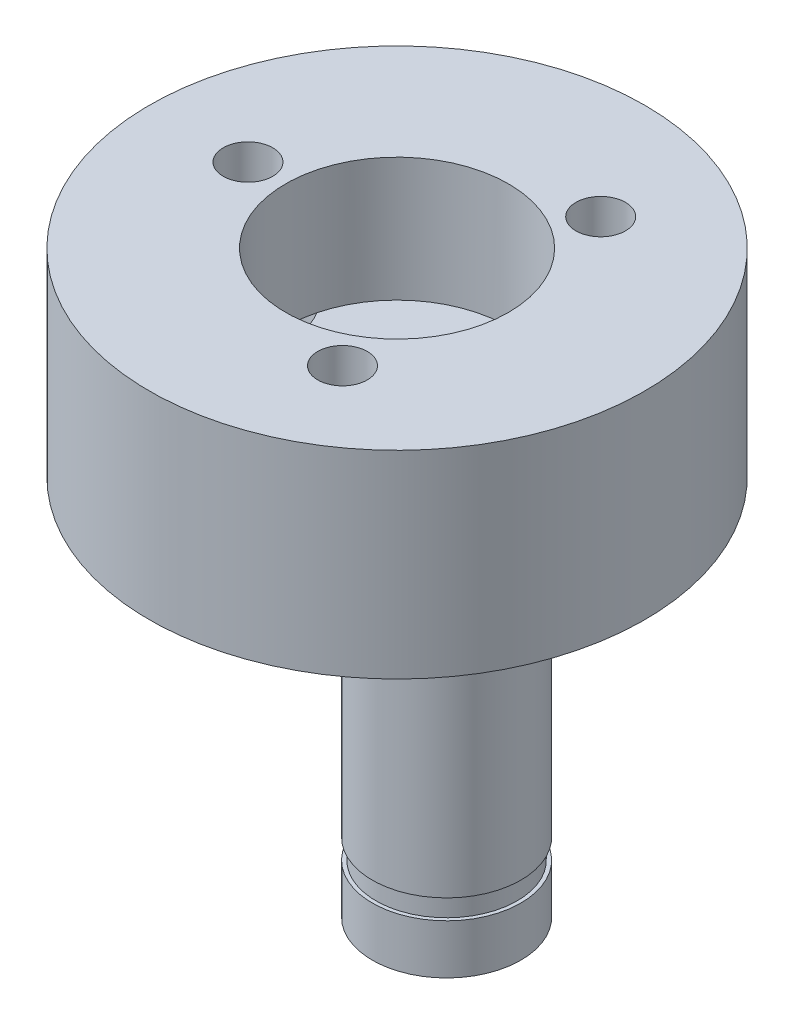
ISO-10303-21;
HEADER;
FILE_DESCRIPTION(('STEP AP214'),'2;1');
FILE_NAME('part.step','',(''),(''),'','','');
FILE_SCHEMA(('AUTOMOTIVE_DESIGN { 1 0 10303 214 1 1 1 1 }'));
ENDSEC;
DATA;
#1=APPLICATION_CONTEXT('core data for automotive mechanical design processes');
#2=APPLICATION_PROTOCOL_DEFINITION('international standard','automotive_design',2000,#1);
#3=PRODUCT_CONTEXT('',#1,'mechanical');
#4=PRODUCT('Part','Part','',(#3));
#5=PRODUCT_RELATED_PRODUCT_CATEGORY('part','',(#4));
#6=PRODUCT_DEFINITION_FORMATION('','',#4);
#7=PRODUCT_DEFINITION_CONTEXT('part definition',#1,'design');
#8=PRODUCT_DEFINITION('design','',#6,#7);
#9=PRODUCT_DEFINITION_SHAPE('','',#8);
#10=(LENGTH_UNIT() NAMED_UNIT(*) SI_UNIT(.MILLI.,.METRE.));
#11=(NAMED_UNIT(*) PLANE_ANGLE_UNIT() SI_UNIT($,.RADIAN.));
#12=(NAMED_UNIT(*) SI_UNIT($,.STERADIAN.) SOLID_ANGLE_UNIT());
#13=UNCERTAINTY_MEASURE_WITH_UNIT(LENGTH_MEASURE(1.E-05),#10,'distance_accuracy_value','');
#14=(GEOMETRIC_REPRESENTATION_CONTEXT(3) GLOBAL_UNCERTAINTY_ASSIGNED_CONTEXT((#13)) GLOBAL_UNIT_ASSIGNED_CONTEXT((#10,
#11,#12)) REPRESENTATION_CONTEXT('',''));
#15=CARTESIAN_POINT('',(0.,0.,0.));
#16=DIRECTION('',(0.,0.,1.));
#17=DIRECTION('',(1.,0.,0.));
#18=AXIS2_PLACEMENT_3D('',#15,#16,#17);
#19=CARTESIAN_POINT('',(0.,-37.,0.));
#20=DIRECTION('',(0.,-1.,0.));
#21=DIRECTION('',(1.,0.,0.));
#22=AXIS2_PLACEMENT_3D('',#19,#20,#21);
#23=PLANE('',#22);
#24=CARTESIAN_POINT('',(-6.02,-37.,0.));
#25=DIRECTION('',(0.,-1.,0.));
#26=DIRECTION('',(1.,0.,0.));
#27=AXIS2_PLACEMENT_3D('',#24,#25,#26);
#28=CIRCLE('',#27,1.);
#29=CARTESIAN_POINT('',(-5.02,-37.,0.));
#30=VERTEX_POINT('',#29);
#31=EDGE_CURVE('E130',#30,#30,#28,.T.);
#32=ORIENTED_EDGE('',*,*,#31,.F.);
#33=EDGE_LOOP('',(#32));
#34=FACE_BOUND('',#33,.T.);
#35=CARTESIAN_POINT('',(0.,-37.,0.));
#36=DIRECTION('',(0.,-1.,0.));
#37=DIRECTION('',(1.,0.,0.));
#38=AXIS2_PLACEMENT_3D('',#35,#36,#37);
#39=CIRCLE('',#38,4.5);
#40=CARTESIAN_POINT('',(-4.35966777408638,-37.,1.11503224150368));
#41=VERTEX_POINT('',#40);
#42=CARTESIAN_POINT('',(-4.35966777408638,-37.,-1.11503224150368));
#43=VERTEX_POINT('',#42);
#44=EDGE_CURVE('E74',#41,#43,#39,.T.);
#45=ORIENTED_EDGE('',*,*,#44,.F.);
#46=CARTESIAN_POINT('',(-6.02,-37.,0.));
#47=DIRECTION('',(0.,-1.,0.));
#48=DIRECTION('',(0.,0.,-1.));
#49=AXIS2_PLACEMENT_3D('',#46,#47,#48);
#50=CIRCLE('',#49,2.);
#51=EDGE_CURVE('E80',#41,#43,#50,.T.);
#52=ORIENTED_EDGE('',*,*,#51,.T.);
#53=EDGE_LOOP('',(#45,#52));
#54=FACE_BOUND('',#53,.T.);
#55=ADVANCED_FACE('F17',(#34,#54),#23,.T.);
#56=CARTESIAN_POINT('',(3.01,-37.,5.21347293078232));
#57=DIRECTION('',(0.,-1.,0.));
#58=DIRECTION('',(1.,0.,0.));
#59=AXIS2_PLACEMENT_3D('',#56,#57,#58);
#60=CIRCLE('',#59,1.);
#61=CARTESIAN_POINT('',(4.01,-37.,5.21347293078232));
#62=VERTEX_POINT('',#61);
#63=EDGE_CURVE('E101',#62,#62,#60,.T.);
#64=ORIENTED_EDGE('',*,*,#63,.F.);
#65=EDGE_LOOP('',(#64));
#66=FACE_BOUND('',#65,.T.);
#67=CARTESIAN_POINT('',(3.14548013422408,-37.,3.21806692366733));
#68=VERTEX_POINT('',#67);
#69=CARTESIAN_POINT('',(1.2141876398623,-37.,4.333099165171));
#70=VERTEX_POINT('',#69);
#71=EDGE_CURVE('E97',#68,#70,#39,.T.);
#72=ORIENTED_EDGE('',*,*,#71,.F.);
#73=CARTESIAN_POINT('',(3.01,-37.,5.21347293078232));
#74=DIRECTION('',(0.,-1.,0.));
#75=DIRECTION('',(0.,0.,-1.));
#76=AXIS2_PLACEMENT_3D('',#73,#74,#75);
#77=CIRCLE('',#76,2.);
#78=EDGE_CURVE('E141',#68,#70,#77,.T.);
#79=ORIENTED_EDGE('',*,*,#78,.T.);
#80=EDGE_LOOP('',(#72,#79));
#81=FACE_BOUND('',#80,.T.);
#82=ADVANCED_FACE('F199',(#66,#81),#23,.T.);
#83=CARTESIAN_POINT('',(3.01,-37.,-5.21347293078232));
#84=DIRECTION('',(0.,-1.,0.));
#85=DIRECTION('',(1.,0.,0.));
#86=AXIS2_PLACEMENT_3D('',#83,#84,#85);
#87=CIRCLE('',#86,1.);
#88=CARTESIAN_POINT('',(4.01,-37.,-5.21347293078232));
#89=VERTEX_POINT('',#88);
#90=EDGE_CURVE('E125',#89,#89,#87,.T.);
#91=ORIENTED_EDGE('',*,*,#90,.F.);
#92=EDGE_LOOP('',(#91));
#93=FACE_BOUND('',#92,.T.);
#94=CARTESIAN_POINT('',(1.2141876398623,-37.,-4.333099165171));
#95=VERTEX_POINT('',#94);
#96=CARTESIAN_POINT('',(3.14548013422408,-37.,-3.21806692366733));
#97=VERTEX_POINT('',#96);
#98=EDGE_CURVE('E75',#95,#97,#39,.T.);
#99=ORIENTED_EDGE('',*,*,#98,.F.);
#100=CARTESIAN_POINT('',(3.01,-37.,-5.21347293078232));
#101=DIRECTION('',(0.,-1.,0.));
#102=DIRECTION('',(0.,0.,-1.));
#103=AXIS2_PLACEMENT_3D('',#100,#101,#102);
#104=CIRCLE('',#103,2.);
#105=EDGE_CURVE('E45',#95,#97,#104,.T.);
#106=ORIENTED_EDGE('',*,*,#105,.T.);
#107=EDGE_LOOP('',(#99,#106));
#108=FACE_BOUND('',#107,.T.);
#109=ADVANCED_FACE('F202',(#93,#108),#23,.T.);
#110=CARTESIAN_POINT('',(3.01,-37.,5.21347293078232));
#111=DIRECTION('',(0.,1.,0.));
#112=DIRECTION('',(0.,0.,1.));
#113=AXIS2_PLACEMENT_3D('',#110,#111,#112);
#114=CYLINDRICAL_SURFACE('',#113,1.);
#115=ORIENTED_EDGE('',*,*,#63,.T.);
#116=EDGE_LOOP('',(#115));
#117=FACE_BOUND('',#116,.T.);
#118=CARTESIAN_POINT('',(3.01,-32.,5.21347293078232));
#119=DIRECTION('',(0.,-1.,0.));
#120=DIRECTION('',(1.,0.,0.));
#121=AXIS2_PLACEMENT_3D('',#118,#119,#120);
#122=CIRCLE('',#121,1.);
#123=CARTESIAN_POINT('',(4.01,-32.,5.21347293078232));
#124=VERTEX_POINT('',#123);
#125=EDGE_CURVE('E115',#124,#124,#122,.T.);
#126=ORIENTED_EDGE('',*,*,#125,.F.);
#127=EDGE_LOOP('',(#126));
#128=FACE_BOUND('',#127,.T.);
#129=ADVANCED_FACE('F211',(#117,#128),#114,.F.);
#130=CARTESIAN_POINT('',(-6.02,-37.,0.));
#131=DIRECTION('',(0.,1.,0.));
#132=DIRECTION('',(0.,0.,1.));
#133=AXIS2_PLACEMENT_3D('',#130,#131,#132);
#134=CYLINDRICAL_SURFACE('',#133,1.);
#135=ORIENTED_EDGE('',*,*,#31,.T.);
#136=EDGE_LOOP('',(#135));
#137=FACE_BOUND('',#136,.T.);
#138=CARTESIAN_POINT('',(-6.02,-32.,0.));
#139=DIRECTION('',(0.,-1.,0.));
#140=DIRECTION('',(1.,0.,0.));
#141=AXIS2_PLACEMENT_3D('',#138,#139,#140);
#142=CIRCLE('',#141,1.);
#143=CARTESIAN_POINT('',(-5.02,-32.,0.));
#144=VERTEX_POINT('',#143);
#145=EDGE_CURVE('E112',#144,#144,#142,.T.);
#146=ORIENTED_EDGE('',*,*,#145,.F.);
#147=EDGE_LOOP('',(#146));
#148=FACE_BOUND('',#147,.T.);
#149=ADVANCED_FACE('F216',(#137,#148),#134,.F.);
#150=CARTESIAN_POINT('',(3.01,-37.,-5.21347293078232));
#151=DIRECTION('',(0.,1.,0.));
#152=DIRECTION('',(0.,0.,1.));
#153=AXIS2_PLACEMENT_3D('',#150,#151,#152);
#154=CYLINDRICAL_SURFACE('',#153,1.);
#155=ORIENTED_EDGE('',*,*,#90,.T.);
#156=EDGE_LOOP('',(#155));
#157=FACE_BOUND('',#156,.T.);
#158=CARTESIAN_POINT('',(3.01,-32.,-5.21347293078232));
#159=DIRECTION('',(0.,-1.,0.));
#160=DIRECTION('',(1.,0.,0.));
#161=AXIS2_PLACEMENT_3D('',#158,#159,#160);
#162=CIRCLE('',#161,1.);
#163=CARTESIAN_POINT('',(4.01,-32.,-5.21347293078232));
#164=VERTEX_POINT('',#163);
#165=EDGE_CURVE('E107',#164,#164,#162,.T.);
#166=ORIENTED_EDGE('',*,*,#165,.F.);
#167=EDGE_LOOP('',(#166));
#168=FACE_BOUND('',#167,.T.);
#169=ADVANCED_FACE('F279',(#157,#168),#154,.F.);
#170=CARTESIAN_POINT('',(0.,-37.,0.));
#171=DIRECTION('',(0.,1.,0.));
#172=DIRECTION('',(0.,0.,1.));
#173=AXIS2_PLACEMENT_3D('',#170,#171,#172);
#174=CYLINDRICAL_SURFACE('',#173,10.);
#175=CARTESIAN_POINT('',(0.,-32.,0.));
#176=DIRECTION('',(0.,-1.,0.));
#177=DIRECTION('',(0.,0.,-1.));
#178=AXIS2_PLACEMENT_3D('',#175,#176,#177);
#179=CIRCLE('',#178,10.);
#180=CARTESIAN_POINT('',(0.,-32.,-10.));
#181=VERTEX_POINT('',#180);
#182=EDGE_CURVE('E103',#181,#181,#179,.T.);
#183=ORIENTED_EDGE('',*,*,#182,.T.);
#184=EDGE_LOOP('',(#183));
#185=FACE_BOUND('',#184,.T.);
#186=CARTESIAN_POINT('',(0.,-40.,0.));
#187=DIRECTION('',(0.,-1.,0.));
#188=DIRECTION('',(0.,0.,-1.));
#189=AXIS2_PLACEMENT_3D('',#186,#187,#188);
#190=CIRCLE('',#189,10.);
#191=CARTESIAN_POINT('',(0.,-40.,-10.));
#192=VERTEX_POINT('',#191);
#193=EDGE_CURVE('E108',#192,#192,#190,.T.);
#194=ORIENTED_EDGE('',*,*,#193,.F.);
#195=EDGE_LOOP('',(#194));
#196=FACE_BOUND('',#195,.T.);
#197=ADVANCED_FACE('F19',(#185,#196),#174,.T.);
#198=CARTESIAN_POINT('',(0.,-37.,0.));
#199=DIRECTION('',(0.,1.,0.));
#200=DIRECTION('',(0.,0.,1.));
#201=AXIS2_PLACEMENT_3D('',#198,#199,#200);
#202=CYLINDRICAL_SURFACE('',#201,4.5);
#203=ORIENTED_EDGE('',*,*,#71,.T.);
#204=EDGE_CURVE('E91',#70,#41,#39,.T.);
#205=ORIENTED_EDGE('',*,*,#204,.T.);
#206=ORIENTED_EDGE('',*,*,#44,.T.);
#207=EDGE_CURVE('E64',#43,#95,#39,.T.);
#208=ORIENTED_EDGE('',*,*,#207,.T.);
#209=ORIENTED_EDGE('',*,*,#98,.T.);
#210=EDGE_CURVE('E100',#97,#68,#39,.T.);
#211=ORIENTED_EDGE('',*,*,#210,.T.);
#212=EDGE_LOOP('',(#203,#205,#206,#208,#209,#211));
#213=FACE_BOUND('',#212,.T.);
#214=CARTESIAN_POINT('',(0.,-32.,0.));
#215=DIRECTION('',(0.,-1.,0.));
#216=DIRECTION('',(1.,0.,0.));
#217=AXIS2_PLACEMENT_3D('',#214,#215,#216);
#218=CIRCLE('',#217,4.5);
#219=CARTESIAN_POINT('',(4.5,-32.,0.));
#220=VERTEX_POINT('',#219);
#221=EDGE_CURVE('E21',#220,#220,#218,.T.);
#222=ORIENTED_EDGE('',*,*,#221,.F.);
#223=EDGE_LOOP('',(#222));
#224=FACE_BOUND('',#223,.T.);
#225=ADVANCED_FACE('F89',(#213,#224),#202,.F.);
#226=CARTESIAN_POINT('',(0.,-32.,0.));
#227=DIRECTION('',(0.,-1.,0.));
#228=DIRECTION('',(1.,0.,0.));
#229=AXIS2_PLACEMENT_3D('',#226,#227,#228);
#230=PLANE('',#229);
#231=ORIENTED_EDGE('',*,*,#182,.F.);
#232=EDGE_LOOP('',(#231));
#233=FACE_BOUND('',#232,.T.);
#234=ORIENTED_EDGE('',*,*,#165,.T.);
#235=EDGE_LOOP('',(#234));
#236=FACE_BOUND('',#235,.T.);
#237=ORIENTED_EDGE('',*,*,#145,.T.);
#238=EDGE_LOOP('',(#237));
#239=FACE_BOUND('',#238,.T.);
#240=ORIENTED_EDGE('',*,*,#125,.T.);
#241=EDGE_LOOP('',(#240));
#242=FACE_BOUND('',#241,.T.);
#243=ORIENTED_EDGE('',*,*,#221,.T.);
#244=EDGE_LOOP('',(#243));
#245=FACE_BOUND('',#244,.T.);
#246=ADVANCED_FACE('F307',(#233,#236,#239,#242,#245),#230,.F.);
#247=CARTESIAN_POINT('',(3.01,-40.,-5.21347293078232));
#248=DIRECTION('',(0.,1.,0.));
#249=DIRECTION('',(0.,0.,1.));
#250=AXIS2_PLACEMENT_3D('',#247,#248,#249);
#251=CYLINDRICAL_SURFACE('',#250,2.);
#252=CARTESIAN_POINT('',(3.01,-40.,-5.21347293078232));
#253=DIRECTION('',(0.,-1.,0.));
#254=DIRECTION('',(0.,0.,-1.));
#255=AXIS2_PLACEMENT_3D('',#252,#253,#254);
#256=CIRCLE('',#255,2.);
#257=CARTESIAN_POINT('',(3.01,-40.,-7.21347293078232));
#258=VERTEX_POINT('',#257);
#259=EDGE_CURVE('E148',#258,#258,#256,.T.);
#260=ORIENTED_EDGE('',*,*,#259,.T.);
#261=EDGE_LOOP('',(#260));
#262=FACE_BOUND('',#261,.T.);
#263=EDGE_CURVE('E39',#97,#95,#104,.T.);
#264=ORIENTED_EDGE('',*,*,#263,.F.);
#265=ORIENTED_EDGE('',*,*,#105,.F.);
#266=EDGE_LOOP('',(#264,#265));
#267=FACE_BOUND('',#266,.T.);
#268=ADVANCED_FACE('F317',(#262,#267),#251,.F.);
#269=CARTESIAN_POINT('',(3.01,-40.,5.21347293078232));
#270=DIRECTION('',(0.,1.,0.));
#271=DIRECTION('',(0.,0.,1.));
#272=AXIS2_PLACEMENT_3D('',#269,#270,#271);
#273=CYLINDRICAL_SURFACE('',#272,2.);
#274=CARTESIAN_POINT('',(3.01,-40.,5.21347293078232));
#275=DIRECTION('',(0.,-1.,0.));
#276=DIRECTION('',(0.,0.,-1.));
#277=AXIS2_PLACEMENT_3D('',#274,#275,#276);
#278=CIRCLE('',#277,2.);
#279=CARTESIAN_POINT('',(3.01,-40.,3.21347293078232));
#280=VERTEX_POINT('',#279);
#281=EDGE_CURVE('E152',#280,#280,#278,.T.);
#282=ORIENTED_EDGE('',*,*,#281,.T.);
#283=EDGE_LOOP('',(#282));
#284=FACE_BOUND('',#283,.T.);
#285=ORIENTED_EDGE('',*,*,#78,.F.);
#286=EDGE_CURVE('E82',#70,#68,#77,.T.);
#287=ORIENTED_EDGE('',*,*,#286,.F.);
#288=EDGE_LOOP('',(#285,#287));
#289=FACE_BOUND('',#288,.T.);
#290=ADVANCED_FACE('F234',(#284,#289),#273,.F.);
#291=CARTESIAN_POINT('',(-6.02,-40.,0.));
#292=DIRECTION('',(0.,1.,0.));
#293=DIRECTION('',(0.,0.,1.));
#294=AXIS2_PLACEMENT_3D('',#291,#292,#293);
#295=CYLINDRICAL_SURFACE('',#294,2.);
#296=CARTESIAN_POINT('',(-6.02,-40.,0.));
#297=DIRECTION('',(0.,-1.,0.));
#298=DIRECTION('',(0.,0.,-1.));
#299=AXIS2_PLACEMENT_3D('',#296,#297,#298);
#300=CIRCLE('',#299,2.);
#301=CARTESIAN_POINT('',(-6.02,-40.,-2.));
#302=VERTEX_POINT('',#301);
#303=EDGE_CURVE('E140',#302,#302,#300,.T.);
#304=ORIENTED_EDGE('',*,*,#303,.T.);
#305=EDGE_LOOP('',(#304));
#306=FACE_BOUND('',#305,.T.);
#307=EDGE_CURVE('E67',#43,#41,#50,.T.);
#308=ORIENTED_EDGE('',*,*,#307,.F.);
#309=ORIENTED_EDGE('',*,*,#51,.F.);
#310=EDGE_LOOP('',(#308,#309));
#311=FACE_BOUND('',#310,.T.);
#312=ADVANCED_FACE('F79',(#306,#311),#295,.F.);
#313=CARTESIAN_POINT('',(0.,-40.,0.));
#314=DIRECTION('',(0.,-1.,0.));
#315=DIRECTION('',(1.,0.,0.));
#316=AXIS2_PLACEMENT_3D('',#313,#314,#315);
#317=PLANE('',#316);
#318=CARTESIAN_POINT('',(2.,-40.,0.));
#319=DIRECTION('',(0.,-1.,0.));
#320=DIRECTION('',(0.,0.,-1.));
#321=AXIS2_PLACEMENT_3D('',#318,#319,#320);
#322=CIRCLE('',#321,3.);
#323=CARTESIAN_POINT('',(2.,-40.,-3.));
#324=VERTEX_POINT('',#323);
#325=EDGE_CURVE('E27',#324,#324,#322,.T.);
#326=ORIENTED_EDGE('',*,*,#325,.F.);
#327=EDGE_LOOP('',(#326));
#328=FACE_BOUND('',#327,.T.);
#329=ORIENTED_EDGE('',*,*,#303,.F.);
#330=EDGE_LOOP('',(#329));
#331=FACE_BOUND('',#330,.T.);
#332=ORIENTED_EDGE('',*,*,#281,.F.);
#333=EDGE_LOOP('',(#332));
#334=FACE_BOUND('',#333,.T.);
#335=ORIENTED_EDGE('',*,*,#259,.F.);
#336=EDGE_LOOP('',(#335));
#337=FACE_BOUND('',#336,.T.);
#338=ORIENTED_EDGE('',*,*,#193,.T.);
#339=EDGE_LOOP('',(#338));
#340=FACE_BOUND('',#339,.T.);
#341=ADVANCED_FACE('F346',(#328,#331,#334,#337,#340),#317,.T.);
#342=CARTESIAN_POINT('',(0.,-37.,0.));
#343=DIRECTION('',(0.,-1.,0.));
#344=DIRECTION('',(1.,0.,0.));
#345=AXIS2_PLACEMENT_3D('',#342,#343,#344);
#346=PLANE('',#345);
#347=ORIENTED_EDGE('',*,*,#204,.F.);
#348=ORIENTED_EDGE('',*,*,#286,.T.);
#349=ORIENTED_EDGE('',*,*,#210,.F.);
#350=ORIENTED_EDGE('',*,*,#263,.T.);
#351=ORIENTED_EDGE('',*,*,#207,.F.);
#352=ORIENTED_EDGE('',*,*,#307,.T.);
#353=EDGE_LOOP('',(#347,#348,#349,#350,#351,#352));
#354=FACE_BOUND('',#353,.T.);
#355=ADVANCED_FACE('F66',(#354),#346,.F.);
#356=CARTESIAN_POINT('',(2.,-43.5,0.));
#357=DIRECTION('',(0.,1.,0.));
#358=DIRECTION('',(0.,0.,1.));
#359=AXIS2_PLACEMENT_3D('',#356,#357,#358);
#360=CYLINDRICAL_SURFACE('',#359,3.);
#361=ORIENTED_EDGE('',*,*,#325,.T.);
#362=EDGE_LOOP('',(#361));
#363=FACE_BOUND('',#362,.T.);
#364=CARTESIAN_POINT('',(2.,-51.604,0.));
#365=DIRECTION('',(0.,-1.,0.));
#366=DIRECTION('',(0.,0.,-1.));
#367=AXIS2_PLACEMENT_3D('',#364,#365,#366);
#368=CIRCLE('',#367,3.);
#369=CARTESIAN_POINT('',(2.,-51.604,-3.));
#370=VERTEX_POINT('',#369);
#371=EDGE_CURVE('E83',#370,#370,#368,.T.);
#372=ORIENTED_EDGE('',*,*,#371,.F.);
#373=EDGE_LOOP('',(#372));
#374=FACE_BOUND('',#373,.T.);
#375=ADVANCED_FACE('F366',(#363,#374),#360,.T.);
#376=CARTESIAN_POINT('',(16.,-51.604,0.));
#377=DIRECTION('',(0.,-1.,0.));
#378=DIRECTION('',(1.,0.,0.));
#379=AXIS2_PLACEMENT_3D('',#376,#377,#378);
#380=PLANE('',#379);
#381=CARTESIAN_POINT('',(2.,-51.604,0.));
#382=DIRECTION('',(0.,-1.,0.));
#383=DIRECTION('',(0.,0.,-1.));
#384=AXIS2_PLACEMENT_3D('',#381,#382,#383);
#385=CIRCLE('',#384,2.85);
#386=CARTESIAN_POINT('',(2.,-51.604,-2.85));
#387=VERTEX_POINT('',#386);
#388=EDGE_CURVE('E11',#387,#387,#385,.T.);
#389=ORIENTED_EDGE('',*,*,#388,.F.);
#390=EDGE_LOOP('',(#389));
#391=FACE_BOUND('',#390,.T.);
#392=ORIENTED_EDGE('',*,*,#371,.T.);
#393=EDGE_LOOP('',(#392));
#394=FACE_BOUND('',#393,.T.);
#395=ADVANCED_FACE('F376',(#391,#394),#380,.T.);
#396=CARTESIAN_POINT('',(2.,-52.404,0.));
#397=DIRECTION('',(0.,1.,0.));
#398=DIRECTION('',(0.,0.,1.));
#399=AXIS2_PLACEMENT_3D('',#396,#397,#398);
#400=CYLINDRICAL_SURFACE('',#399,2.85);
#401=CARTESIAN_POINT('',(2.,-52.404,0.));
#402=DIRECTION('',(0.,-1.,0.));
#403=DIRECTION('',(0.,0.,-1.));
#404=AXIS2_PLACEMENT_3D('',#401,#402,#403);
#405=CIRCLE('',#404,2.85);
#406=CARTESIAN_POINT('',(2.,-52.404,-2.85));
#407=VERTEX_POINT('',#406);
#408=EDGE_CURVE('E164',#407,#407,#405,.T.);
#409=ORIENTED_EDGE('',*,*,#408,.F.);
#410=EDGE_LOOP('',(#409));
#411=FACE_BOUND('',#410,.T.);
#412=ORIENTED_EDGE('',*,*,#388,.T.);
#413=EDGE_LOOP('',(#412));
#414=FACE_BOUND('',#413,.T.);
#415=ADVANCED_FACE('F185',(#411,#414),#400,.T.);
#416=CARTESIAN_POINT('',(2.,-54.404,0.));
#417=DIRECTION('',(0.,1.,0.));
#418=DIRECTION('',(0.,0.,1.));
#419=AXIS2_PLACEMENT_3D('',#416,#417,#418);
#420=CYLINDRICAL_SURFACE('',#419,3.);
#421=CARTESIAN_POINT('',(2.,-54.404,0.));
#422=DIRECTION('',(0.,-1.,0.));
#423=DIRECTION('',(0.,0.,-1.));
#424=AXIS2_PLACEMENT_3D('',#421,#422,#423);
#425=CIRCLE('',#424,3.);
#426=CARTESIAN_POINT('',(2.,-54.404,-3.));
#427=VERTEX_POINT('',#426);
#428=EDGE_CURVE('E169',#427,#427,#425,.T.);
#429=ORIENTED_EDGE('',*,*,#428,.F.);
#430=EDGE_LOOP('',(#429));
#431=FACE_BOUND('',#430,.T.);
#432=CARTESIAN_POINT('',(2.,-52.404,0.));
#433=DIRECTION('',(0.,-1.,0.));
#434=DIRECTION('',(0.,0.,-1.));
#435=AXIS2_PLACEMENT_3D('',#432,#433,#434);
#436=CIRCLE('',#435,3.);
#437=CARTESIAN_POINT('',(2.,-52.404,-3.));
#438=VERTEX_POINT('',#437);
#439=EDGE_CURVE('E170',#438,#438,#436,.T.);
#440=ORIENTED_EDGE('',*,*,#439,.T.);
#441=EDGE_LOOP('',(#440));
#442=FACE_BOUND('',#441,.T.);
#443=ADVANCED_FACE('F182',(#431,#442),#420,.T.);
#444=CARTESIAN_POINT('',(2.,-54.404,0.));
#445=DIRECTION('',(0.,-1.,0.));
#446=DIRECTION('',(1.,0.,0.));
#447=AXIS2_PLACEMENT_3D('',#444,#445,#446);
#448=PLANE('',#447);
#449=ORIENTED_EDGE('',*,*,#428,.T.);
#450=EDGE_LOOP('',(#449));
#451=FACE_BOUND('',#450,.T.);
#452=ADVANCED_FACE('F180',(#451),#448,.T.);
#453=CARTESIAN_POINT('',(2.,-52.404,0.));
#454=DIRECTION('',(0.,-1.,0.));
#455=DIRECTION('',(1.,0.,0.));
#456=AXIS2_PLACEMENT_3D('',#453,#454,#455);
#457=PLANE('',#456);
#458=ORIENTED_EDGE('',*,*,#408,.T.);
#459=EDGE_LOOP('',(#458));
#460=FACE_BOUND('',#459,.T.);
#461=ORIENTED_EDGE('',*,*,#439,.F.);
#462=EDGE_LOOP('',(#461));
#463=FACE_BOUND('',#462,.T.);
#464=ADVANCED_FACE('F189',(#460,#463),#457,.F.);
#465=CLOSED_SHELL('',(#55,#82,#109,#129,#149,#169,#197,#225,#246,#268,#290,#312,#341,#355,#375,
#395,#415,#443,#452,#464));
#466=MANIFOLD_SOLID_BREP('B1',#465);
#467=ADVANCED_BREP_SHAPE_REPRESENTATION('',(#18,#466),#14);
#468=SHAPE_DEFINITION_REPRESENTATION(#9,#467);
ENDSEC;
END-ISO-10303-21;
